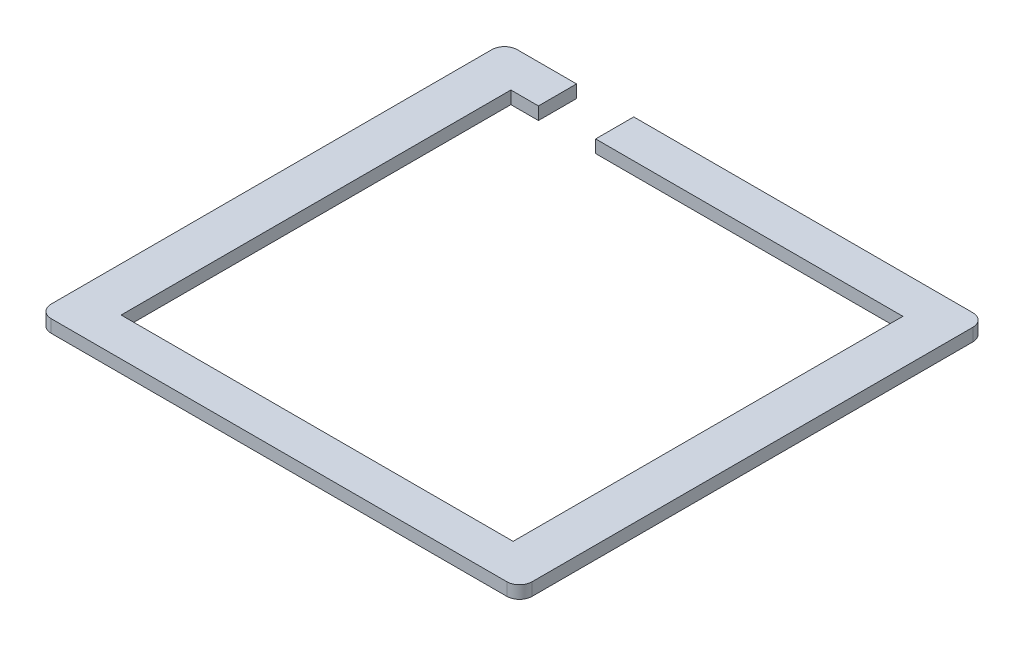
ISO-10303-21;
HEADER;
FILE_DESCRIPTION(('STEP AP214'),'2;1');
FILE_NAME('part.step','',(''),(''),'','','');
FILE_SCHEMA(('AUTOMOTIVE_DESIGN { 1 0 10303 214 1 1 1 1 }'));
ENDSEC;
DATA;
#1=APPLICATION_CONTEXT('core data for automotive mechanical design processes');
#2=APPLICATION_PROTOCOL_DEFINITION('international standard','automotive_design',2000,#1);
#3=PRODUCT_CONTEXT('',#1,'mechanical');
#4=PRODUCT('Part','Part','',(#3));
#5=PRODUCT_RELATED_PRODUCT_CATEGORY('part','',(#4));
#6=PRODUCT_DEFINITION_FORMATION('','',#4);
#7=PRODUCT_DEFINITION_CONTEXT('part definition',#1,'design');
#8=PRODUCT_DEFINITION('design','',#6,#7);
#9=PRODUCT_DEFINITION_SHAPE('','',#8);
#10=(LENGTH_UNIT() NAMED_UNIT(*) SI_UNIT(.MILLI.,.METRE.));
#11=(NAMED_UNIT(*) PLANE_ANGLE_UNIT() SI_UNIT($,.RADIAN.));
#12=(NAMED_UNIT(*) SI_UNIT($,.STERADIAN.) SOLID_ANGLE_UNIT());
#13=UNCERTAINTY_MEASURE_WITH_UNIT(LENGTH_MEASURE(1.E-05),#10,'distance_accuracy_value','');
#14=(GEOMETRIC_REPRESENTATION_CONTEXT(3) GLOBAL_UNCERTAINTY_ASSIGNED_CONTEXT((#13)) GLOBAL_UNIT_ASSIGNED_CONTEXT((#10,
#11,#12)) REPRESENTATION_CONTEXT('',''));
#15=CARTESIAN_POINT('',(0.,0.,0.));
#16=DIRECTION('',(0.,0.,1.));
#17=DIRECTION('',(1.,0.,0.));
#18=AXIS2_PLACEMENT_3D('',#15,#16,#17);
#19=CARTESIAN_POINT('',(-245.872231058257,-2419.78814298931,-89.0156255440787));
#20=DIRECTION('',(0.,0.,1.));
#21=DIRECTION('',(1.,0.,0.));
#22=AXIS2_PLACEMENT_3D('',#19,#20,#21);
#23=PLANE('',#22);
#24=DIRECTION('',(-1.,0.,0.));
#25=VECTOR('',#24,1.);
#26=CARTESIAN_POINT('',(-245.872231058257,-2419.78814298931,-89.0156255440787));
#27=LINE('',#26,#25);
#28=CARTESIAN_POINT('',(-236.533164197027,-2419.78814298931,-89.0156255440787));
#29=VERTEX_POINT('',#28);
#30=CARTESIAN_POINT('',(-245.872231058257,-2419.78814298931,-89.0156255440787));
#31=VERTEX_POINT('',#30);
#32=EDGE_CURVE('E190',#29,#31,#27,.T.);
#33=ORIENTED_EDGE('',*,*,#32,.F.);
#34=DIRECTION('',(0.,1.,0.));
#35=VECTOR('',#34,1.);
#36=CARTESIAN_POINT('',(-236.533164197027,-2421.78814298931,-89.0156255440787));
#37=LINE('',#36,#35);
#38=CARTESIAN_POINT('',(-236.533164197027,-2421.78814298931,-89.0156255440787));
#39=VERTEX_POINT('',#38);
#40=EDGE_CURVE('E263',#39,#29,#37,.T.);
#41=ORIENTED_EDGE('',*,*,#40,.F.);
#42=DIRECTION('',(-1.,0.,0.));
#43=VECTOR('',#42,1.);
#44=CARTESIAN_POINT('',(-245.872231058257,-2421.78814298931,-89.0156255440787));
#45=LINE('',#44,#43);
#46=CARTESIAN_POINT('',(-245.872231058257,-2421.78814298931,-89.0156255440787));
#47=VERTEX_POINT('',#46);
#48=EDGE_CURVE('E160',#39,#47,#45,.T.);
#49=ORIENTED_EDGE('',*,*,#48,.T.);
#50=DIRECTION('',(0.,-1.,0.));
#51=VECTOR('',#50,1.);
#52=CARTESIAN_POINT('',(-245.872231058257,-2419.78814298931,-89.0156255440787));
#53=LINE('',#52,#51);
#54=EDGE_CURVE('E41',#31,#47,#53,.T.);
#55=ORIENTED_EDGE('',*,*,#54,.F.);
#56=EDGE_LOOP('',(#33,#41,#49,#55));
#57=FACE_BOUND('',#56,.T.);
#58=ADVANCED_FACE('F33',(#57),#23,.F.);
#59=CARTESIAN_POINT('',(-240.872231058257,-2419.78814298931,-83.0156255440787));
#60=DIRECTION('',(0.,0.,1.));
#61=DIRECTION('',(1.,0.,0.));
#62=AXIS2_PLACEMENT_3D('',#59,#60,#61);
#63=PLANE('',#62);
#64=DIRECTION('',(0.,1.,0.));
#65=VECTOR('',#64,1.);
#66=CARTESIAN_POINT('',(-236.533164197027,-2421.78814298931,-83.0156255440787));
#67=LINE('',#66,#65);
#68=CARTESIAN_POINT('',(-236.533164197027,-2421.78814298931,-83.0156255440787));
#69=VERTEX_POINT('',#68);
#70=CARTESIAN_POINT('',(-236.533164197027,-2419.78814298931,-83.0156255440787));
#71=VERTEX_POINT('',#70);
#72=EDGE_CURVE('E143',#69,#71,#67,.T.);
#73=ORIENTED_EDGE('',*,*,#72,.T.);
#74=DIRECTION('',(-1.,0.,0.));
#75=VECTOR('',#74,1.);
#76=CARTESIAN_POINT('',(-240.872231058257,-2419.78814298931,-83.0156255440787));
#77=LINE('',#76,#75);
#78=CARTESIAN_POINT('',(-240.872231058257,-2419.78814298931,-83.0156255440787));
#79=VERTEX_POINT('',#78);
#80=EDGE_CURVE('E280',#71,#79,#77,.T.);
#81=ORIENTED_EDGE('',*,*,#80,.T.);
#82=DIRECTION('',(0.,-1.,0.));
#83=VECTOR('',#82,1.);
#84=CARTESIAN_POINT('',(-240.872231058257,-2419.78814298931,-83.0156255440787));
#85=LINE('',#84,#83);
#86=CARTESIAN_POINT('',(-240.872231058257,-2421.78814298931,-83.0156255440787));
#87=VERTEX_POINT('',#86);
#88=EDGE_CURVE('E166',#79,#87,#85,.T.);
#89=ORIENTED_EDGE('',*,*,#88,.T.);
#90=DIRECTION('',(-1.,0.,0.));
#91=VECTOR('',#90,1.);
#92=CARTESIAN_POINT('',(-240.872231058257,-2421.78814298931,-83.0156255440787));
#93=LINE('',#92,#91);
#94=EDGE_CURVE('E157',#69,#87,#93,.T.);
#95=ORIENTED_EDGE('',*,*,#94,.F.);
#96=EDGE_LOOP('',(#73,#81,#89,#95));
#97=FACE_BOUND('',#96,.T.);
#98=ADVANCED_FACE('F164',(#97),#63,.T.);
#99=CARTESIAN_POINT('',(-174.170088447034,-2419.78814298931,-87.0156255440787));
#100=DIRECTION('',(0.,-1.,0.));
#101=DIRECTION('',(0.,0.,-1.));
#102=AXIS2_PLACEMENT_3D('',#99,#100,#101);
#103=PLANE('',#102);
#104=ORIENTED_EDGE('',*,*,#80,.F.);
#105=DIRECTION('',(0.,0.,1.));
#106=VECTOR('',#105,1.);
#107=CARTESIAN_POINT('',(-236.533164197027,-2419.78814298931,-89.0156255440787));
#108=LINE('',#107,#106);
#109=EDGE_CURVE('E48',#29,#71,#108,.T.);
#110=ORIENTED_EDGE('',*,*,#109,.F.);
#111=ORIENTED_EDGE('',*,*,#32,.T.);
#112=CARTESIAN_POINT('',(-245.872231058257,-2419.78814298931,-87.0156255440787));
#113=DIRECTION('',(0.,1.,0.));
#114=DIRECTION('',(0.,0.,-1.));
#115=AXIS2_PLACEMENT_3D('',#112,#113,#114);
#116=CIRCLE('',#115,2.);
#117=CARTESIAN_POINT('',(-247.872231058257,-2419.78814298931,-87.0156255440787));
#118=VERTEX_POINT('',#117);
#119=EDGE_CURVE('E195',#31,#118,#116,.T.);
#120=ORIENTED_EDGE('',*,*,#119,.T.);
#121=DIRECTION('',(0.,0.,1.));
#122=VECTOR('',#121,1.);
#123=CARTESIAN_POINT('',(-247.872231058257,-2419.78814298931,-87.0156255440787));
#124=LINE('',#123,#122);
#125=CARTESIAN_POINT('',(-247.872231058257,-2419.78814298931,-17.6683856450978));
#126=VERTEX_POINT('',#125);
#127=EDGE_CURVE('E197',#118,#126,#124,.T.);
#128=ORIENTED_EDGE('',*,*,#127,.T.);
#129=CARTESIAN_POINT('',(-245.872231058257,-2419.78814298931,-17.6683856450978));
#130=DIRECTION('',(0.,1.,0.));
#131=DIRECTION('',(0.,0.,-1.));
#132=AXIS2_PLACEMENT_3D('',#129,#130,#131);
#133=CIRCLE('',#132,2.);
#134=CARTESIAN_POINT('',(-245.872231058257,-2419.78814298931,-15.6683856450978));
#135=VERTEX_POINT('',#134);
#136=EDGE_CURVE('E199',#126,#135,#133,.T.);
#137=ORIENTED_EDGE('',*,*,#136,.T.);
#138=DIRECTION('',(1.,0.,0.));
#139=VECTOR('',#138,1.);
#140=CARTESIAN_POINT('',(-245.872231058257,-2419.78814298931,-15.6683856450978));
#141=LINE('',#140,#139);
#142=CARTESIAN_POINT('',(-174.170088447034,-2419.78814298931,-15.6683856450978));
#143=VERTEX_POINT('',#142);
#144=EDGE_CURVE('E201',#135,#143,#141,.T.);
#145=ORIENTED_EDGE('',*,*,#144,.T.);
#146=CARTESIAN_POINT('',(-174.170088447034,-2419.78814298931,-17.6683856450978));
#147=DIRECTION('',(0.,1.,0.));
#148=DIRECTION('',(0.,0.,-1.));
#149=AXIS2_PLACEMENT_3D('',#146,#147,#148);
#150=CIRCLE('',#149,2.);
#151=CARTESIAN_POINT('',(-172.170088447034,-2419.78814298931,-17.6683856450978));
#152=VERTEX_POINT('',#151);
#153=EDGE_CURVE('E203',#143,#152,#150,.T.);
#154=ORIENTED_EDGE('',*,*,#153,.T.);
#155=DIRECTION('',(0.,0.,-1.));
#156=VECTOR('',#155,1.);
#157=CARTESIAN_POINT('',(-172.170088447034,-2419.78814298931,-87.0156255440787));
#158=LINE('',#157,#156);
#159=CARTESIAN_POINT('',(-172.170088447034,-2419.78814298931,-87.0156255440787));
#160=VERTEX_POINT('',#159);
#161=EDGE_CURVE('E205',#152,#160,#158,.T.);
#162=ORIENTED_EDGE('',*,*,#161,.T.);
#163=CARTESIAN_POINT('',(-174.170088447034,-2419.78814298931,-87.0156255440787));
#164=DIRECTION('',(0.,1.,0.));
#165=DIRECTION('',(0.,0.,-1.));
#166=AXIS2_PLACEMENT_3D('',#163,#164,#165);
#167=CIRCLE('',#166,2.);
#168=CARTESIAN_POINT('',(-174.170088447034,-2419.78814298931,-89.0156255440787));
#169=VERTEX_POINT('',#168);
#170=EDGE_CURVE('E187',#160,#169,#167,.T.);
#171=ORIENTED_EDGE('',*,*,#170,.T.);
#172=CARTESIAN_POINT('',(-227.533164197027,-2419.78814298931,-89.0156255440787));
#173=VERTEX_POINT('',#172);
#174=EDGE_CURVE('E192',#169,#173,#27,.T.);
#175=ORIENTED_EDGE('',*,*,#174,.T.);
#176=DIRECTION('',(0.,0.,-1.));
#177=VECTOR('',#176,1.);
#178=CARTESIAN_POINT('',(-227.533164197027,-2419.78814298931,-89.0156255440787));
#179=LINE('',#178,#177);
#180=CARTESIAN_POINT('',(-227.533164197027,-2419.78814298931,-83.0156255440787));
#181=VERTEX_POINT('',#180);
#182=EDGE_CURVE('E161',#181,#173,#179,.T.);
#183=ORIENTED_EDGE('',*,*,#182,.F.);
#184=CARTESIAN_POINT('',(-179.170088447034,-2419.78814298931,-83.0156255440787));
#185=VERTEX_POINT('',#184);
#186=EDGE_CURVE('E179',#185,#181,#77,.T.);
#187=ORIENTED_EDGE('',*,*,#186,.F.);
#188=DIRECTION('',(0.,0.,-1.));
#189=VECTOR('',#188,1.);
#190=CARTESIAN_POINT('',(-179.170088447034,-2419.78814298931,-83.0156255440787));
#191=LINE('',#190,#189);
#192=CARTESIAN_POINT('',(-179.170088447034,-2419.78814298931,-21.6683856450978));
#193=VERTEX_POINT('',#192);
#194=EDGE_CURVE('E277',#193,#185,#191,.T.);
#195=ORIENTED_EDGE('',*,*,#194,.F.);
#196=DIRECTION('',(1.,0.,0.));
#197=VECTOR('',#196,1.);
#198=CARTESIAN_POINT('',(-240.872231058257,-2419.78814298931,-21.6683856450978));
#199=LINE('',#198,#197);
#200=CARTESIAN_POINT('',(-240.872231058257,-2419.78814298931,-21.6683856450978));
#201=VERTEX_POINT('',#200);
#202=EDGE_CURVE('E275',#201,#193,#199,.T.);
#203=ORIENTED_EDGE('',*,*,#202,.F.);
#204=DIRECTION('',(0.,0.,1.));
#205=VECTOR('',#204,1.);
#206=CARTESIAN_POINT('',(-240.872231058257,-2419.78814298931,-83.0156255440787));
#207=LINE('',#206,#205);
#208=EDGE_CURVE('E171',#79,#201,#207,.T.);
#209=ORIENTED_EDGE('',*,*,#208,.F.);
#210=EDGE_LOOP('',(#104,#110,#111,#120,#128,#137,#145,#154,#162,#171,#175,#183,#187,#195,#203,#209));
#211=FACE_BOUND('',#210,.T.);
#212=ADVANCED_FACE('F261',(#211),#103,.F.);
#213=CARTESIAN_POINT('',(-174.170088447034,-2421.78814298931,-87.0156255440787));
#214=DIRECTION('',(0.,-1.,0.));
#215=DIRECTION('',(0.,0.,-1.));
#216=AXIS2_PLACEMENT_3D('',#213,#214,#215);
#217=PLANE('',#216);
#218=DIRECTION('',(0.,0.,1.));
#219=VECTOR('',#218,1.);
#220=CARTESIAN_POINT('',(-236.533164197027,-2421.78814298931,-89.0156255440787));
#221=LINE('',#220,#219);
#222=EDGE_CURVE('E146',#39,#69,#221,.T.);
#223=ORIENTED_EDGE('',*,*,#222,.T.);
#224=ORIENTED_EDGE('',*,*,#94,.T.);
#225=DIRECTION('',(0.,0.,1.));
#226=VECTOR('',#225,1.);
#227=CARTESIAN_POINT('',(-240.872231058257,-2421.78814298931,-83.0156255440787));
#228=LINE('',#227,#226);
#229=CARTESIAN_POINT('',(-240.872231058257,-2421.78814298931,-21.6683856450978));
#230=VERTEX_POINT('',#229);
#231=EDGE_CURVE('E264',#87,#230,#228,.T.);
#232=ORIENTED_EDGE('',*,*,#231,.T.);
#233=DIRECTION('',(1.,0.,0.));
#234=VECTOR('',#233,1.);
#235=CARTESIAN_POINT('',(-240.872231058257,-2421.78814298931,-21.6683856450978));
#236=LINE('',#235,#234);
#237=CARTESIAN_POINT('',(-179.170088447034,-2421.78814298931,-21.6683856450978));
#238=VERTEX_POINT('',#237);
#239=EDGE_CURVE('E173',#230,#238,#236,.T.);
#240=ORIENTED_EDGE('',*,*,#239,.T.);
#241=DIRECTION('',(0.,0.,-1.));
#242=VECTOR('',#241,1.);
#243=CARTESIAN_POINT('',(-179.170088447034,-2421.78814298931,-83.0156255440787));
#244=LINE('',#243,#242);
#245=CARTESIAN_POINT('',(-179.170088447034,-2421.78814298931,-83.0156255440787));
#246=VERTEX_POINT('',#245);
#247=EDGE_CURVE('E168',#238,#246,#244,.T.);
#248=ORIENTED_EDGE('',*,*,#247,.T.);
#249=CARTESIAN_POINT('',(-227.533164197027,-2421.78814298931,-83.0156255440787));
#250=VERTEX_POINT('',#249);
#251=EDGE_CURVE('E167',#246,#250,#93,.T.);
#252=ORIENTED_EDGE('',*,*,#251,.T.);
#253=DIRECTION('',(0.,0.,-1.));
#254=VECTOR('',#253,1.);
#255=CARTESIAN_POINT('',(-227.533164197027,-2421.78814298931,-89.0156255440787));
#256=LINE('',#255,#254);
#257=CARTESIAN_POINT('',(-227.533164197027,-2421.78814298931,-89.0156255440787));
#258=VERTEX_POINT('',#257);
#259=EDGE_CURVE('E56',#250,#258,#256,.T.);
#260=ORIENTED_EDGE('',*,*,#259,.T.);
#261=CARTESIAN_POINT('',(-174.170088447034,-2421.78814298931,-89.0156255440787));
#262=VERTEX_POINT('',#261);
#263=EDGE_CURVE('E210',#262,#258,#45,.T.);
#264=ORIENTED_EDGE('',*,*,#263,.F.);
#265=CARTESIAN_POINT('',(-174.170088447034,-2421.78814298931,-87.0156255440787));
#266=DIRECTION('',(0.,1.,0.));
#267=DIRECTION('',(0.,0.,-1.));
#268=AXIS2_PLACEMENT_3D('',#265,#266,#267);
#269=CIRCLE('',#268,2.);
#270=CARTESIAN_POINT('',(-172.170088447034,-2421.78814298931,-87.0156255440787));
#271=VERTEX_POINT('',#270);
#272=EDGE_CURVE('E186',#271,#262,#269,.T.);
#273=ORIENTED_EDGE('',*,*,#272,.F.);
#274=DIRECTION('',(0.,0.,-1.));
#275=VECTOR('',#274,1.);
#276=CARTESIAN_POINT('',(-172.170088447034,-2421.78814298931,-87.0156255440787));
#277=LINE('',#276,#275);
#278=CARTESIAN_POINT('',(-172.170088447034,-2421.78814298931,-17.6683856450978));
#279=VERTEX_POINT('',#278);
#280=EDGE_CURVE('E191',#279,#271,#277,.T.);
#281=ORIENTED_EDGE('',*,*,#280,.F.);
#282=CARTESIAN_POINT('',(-174.170088447034,-2421.78814298931,-17.6683856450978));
#283=DIRECTION('',(0.,1.,0.));
#284=DIRECTION('',(0.,0.,-1.));
#285=AXIS2_PLACEMENT_3D('',#282,#283,#284);
#286=CIRCLE('',#285,2.);
#287=CARTESIAN_POINT('',(-174.170088447034,-2421.78814298931,-15.6683856450978));
#288=VERTEX_POINT('',#287);
#289=EDGE_CURVE('E221',#288,#279,#286,.T.);
#290=ORIENTED_EDGE('',*,*,#289,.F.);
#291=DIRECTION('',(1.,0.,0.));
#292=VECTOR('',#291,1.);
#293=CARTESIAN_POINT('',(-245.872231058257,-2421.78814298931,-15.6683856450978));
#294=LINE('',#293,#292);
#295=CARTESIAN_POINT('',(-245.872231058257,-2421.78814298931,-15.6683856450978));
#296=VERTEX_POINT('',#295);
#297=EDGE_CURVE('E219',#296,#288,#294,.T.);
#298=ORIENTED_EDGE('',*,*,#297,.F.);
#299=CARTESIAN_POINT('',(-245.872231058257,-2421.78814298931,-17.6683856450978));
#300=DIRECTION('',(0.,1.,0.));
#301=DIRECTION('',(0.,0.,-1.));
#302=AXIS2_PLACEMENT_3D('',#299,#300,#301);
#303=CIRCLE('',#302,2.);
#304=CARTESIAN_POINT('',(-247.872231058257,-2421.78814298931,-17.6683856450978));
#305=VERTEX_POINT('',#304);
#306=EDGE_CURVE('E217',#305,#296,#303,.T.);
#307=ORIENTED_EDGE('',*,*,#306,.F.);
#308=DIRECTION('',(0.,0.,1.));
#309=VECTOR('',#308,1.);
#310=CARTESIAN_POINT('',(-247.872231058257,-2421.78814298931,-87.0156255440787));
#311=LINE('',#310,#309);
#312=CARTESIAN_POINT('',(-247.872231058257,-2421.78814298931,-87.0156255440787));
#313=VERTEX_POINT('',#312);
#314=EDGE_CURVE('E215',#313,#305,#311,.T.);
#315=ORIENTED_EDGE('',*,*,#314,.F.);
#316=CARTESIAN_POINT('',(-245.872231058257,-2421.78814298931,-87.0156255440787));
#317=DIRECTION('',(0.,1.,0.));
#318=DIRECTION('',(0.,0.,-1.));
#319=AXIS2_PLACEMENT_3D('',#316,#317,#318);
#320=CIRCLE('',#319,2.);
#321=EDGE_CURVE('E213',#47,#313,#320,.T.);
#322=ORIENTED_EDGE('',*,*,#321,.F.);
#323=ORIENTED_EDGE('',*,*,#48,.F.);
#324=EDGE_LOOP('',(#223,#224,#232,#240,#248,#252,#260,#264,#273,#281,#290,#298,#307,#315,#322,#323));
#325=FACE_BOUND('',#324,.T.);
#326=ADVANCED_FACE('F155',(#325),#217,.T.);
#327=CARTESIAN_POINT('',(-174.170088447034,-2419.78814298931,-87.0156255440787));
#328=DIRECTION('',(0.,-1.,0.));
#329=DIRECTION('',(0.,0.,-1.));
#330=AXIS2_PLACEMENT_3D('',#327,#328,#329);
#331=CYLINDRICAL_SURFACE('',#330,2.);
#332=ORIENTED_EDGE('',*,*,#272,.T.);
#333=DIRECTION('',(0.,-1.,0.));
#334=VECTOR('',#333,1.);
#335=CARTESIAN_POINT('',(-174.170088447034,-2419.78814298931,-89.0156255440787));
#336=LINE('',#335,#334);
#337=EDGE_CURVE('E11',#169,#262,#336,.T.);
#338=ORIENTED_EDGE('',*,*,#337,.F.);
#339=ORIENTED_EDGE('',*,*,#170,.F.);
#340=DIRECTION('',(0.,-1.,0.));
#341=VECTOR('',#340,1.);
#342=CARTESIAN_POINT('',(-172.170088447034,-2419.78814298931,-87.0156255440787));
#343=LINE('',#342,#341);
#344=EDGE_CURVE('E207',#160,#271,#343,.T.);
#345=ORIENTED_EDGE('',*,*,#344,.T.);
#346=EDGE_LOOP('',(#332,#338,#339,#345));
#347=FACE_BOUND('',#346,.T.);
#348=ADVANCED_FACE('F35',(#347),#331,.T.);
#349=ORIENTED_EDGE('',*,*,#263,.T.);
#350=DIRECTION('',(0.,1.,0.));
#351=VECTOR('',#350,1.);
#352=CARTESIAN_POINT('',(-227.533164197027,-2421.78814298931,-89.0156255440787));
#353=LINE('',#352,#351);
#354=EDGE_CURVE('E265',#258,#173,#353,.T.);
#355=ORIENTED_EDGE('',*,*,#354,.T.);
#356=ORIENTED_EDGE('',*,*,#174,.F.);
#357=ORIENTED_EDGE('',*,*,#337,.T.);
#358=EDGE_LOOP('',(#349,#355,#356,#357));
#359=FACE_BOUND('',#358,.T.);
#360=ADVANCED_FACE('F302',(#359),#23,.F.);
#361=CARTESIAN_POINT('',(-245.872231058257,-2419.78814298931,-87.0156255440787));
#362=DIRECTION('',(0.,-1.,0.));
#363=DIRECTION('',(0.,0.,-1.));
#364=AXIS2_PLACEMENT_3D('',#361,#362,#363);
#365=CYLINDRICAL_SURFACE('',#364,2.);
#366=ORIENTED_EDGE('',*,*,#321,.T.);
#367=DIRECTION('',(0.,-1.,0.));
#368=VECTOR('',#367,1.);
#369=CARTESIAN_POINT('',(-247.872231058257,-2419.78814298931,-87.0156255440787));
#370=LINE('',#369,#368);
#371=EDGE_CURVE('E238',#118,#313,#370,.T.);
#372=ORIENTED_EDGE('',*,*,#371,.F.);
#373=ORIENTED_EDGE('',*,*,#119,.F.);
#374=ORIENTED_EDGE('',*,*,#54,.T.);
#375=EDGE_LOOP('',(#366,#372,#373,#374));
#376=FACE_BOUND('',#375,.T.);
#377=ADVANCED_FACE('F244',(#376),#365,.T.);
#378=CARTESIAN_POINT('',(-247.872231058257,-2419.78814298931,-87.0156255440787));
#379=DIRECTION('',(1.,0.,0.));
#380=DIRECTION('',(0.,0.,-1.));
#381=AXIS2_PLACEMENT_3D('',#378,#379,#380);
#382=PLANE('',#381);
#383=ORIENTED_EDGE('',*,*,#314,.T.);
#384=DIRECTION('',(0.,-1.,0.));
#385=VECTOR('',#384,1.);
#386=CARTESIAN_POINT('',(-247.872231058257,-2419.78814298931,-17.6683856450978));
#387=LINE('',#386,#385);
#388=EDGE_CURVE('E235',#126,#305,#387,.T.);
#389=ORIENTED_EDGE('',*,*,#388,.F.);
#390=ORIENTED_EDGE('',*,*,#127,.F.);
#391=ORIENTED_EDGE('',*,*,#371,.T.);
#392=EDGE_LOOP('',(#383,#389,#390,#391));
#393=FACE_BOUND('',#392,.T.);
#394=ADVANCED_FACE('F253',(#393),#382,.F.);
#395=CARTESIAN_POINT('',(-245.872231058257,-2419.78814298931,-17.6683856450978));
#396=DIRECTION('',(0.,-1.,0.));
#397=DIRECTION('',(0.,0.,-1.));
#398=AXIS2_PLACEMENT_3D('',#395,#396,#397);
#399=CYLINDRICAL_SURFACE('',#398,2.);
#400=ORIENTED_EDGE('',*,*,#306,.T.);
#401=DIRECTION('',(0.,-1.,0.));
#402=VECTOR('',#401,1.);
#403=CARTESIAN_POINT('',(-245.872231058257,-2419.78814298931,-15.6683856450978));
#404=LINE('',#403,#402);
#405=EDGE_CURVE('E232',#135,#296,#404,.T.);
#406=ORIENTED_EDGE('',*,*,#405,.F.);
#407=ORIENTED_EDGE('',*,*,#136,.F.);
#408=ORIENTED_EDGE('',*,*,#388,.T.);
#409=EDGE_LOOP('',(#400,#406,#407,#408));
#410=FACE_BOUND('',#409,.T.);
#411=ADVANCED_FACE('F257',(#410),#399,.T.);
#412=CARTESIAN_POINT('',(-245.872231058257,-2419.78814298931,-15.6683856450978));
#413=DIRECTION('',(0.,0.,-1.));
#414=DIRECTION('',(-1.,0.,0.));
#415=AXIS2_PLACEMENT_3D('',#412,#413,#414);
#416=PLANE('',#415);
#417=ORIENTED_EDGE('',*,*,#297,.T.);
#418=DIRECTION('',(0.,-1.,0.));
#419=VECTOR('',#418,1.);
#420=CARTESIAN_POINT('',(-174.170088447034,-2419.78814298931,-15.6683856450978));
#421=LINE('',#420,#419);
#422=EDGE_CURVE('E229',#143,#288,#421,.T.);
#423=ORIENTED_EDGE('',*,*,#422,.F.);
#424=ORIENTED_EDGE('',*,*,#144,.F.);
#425=ORIENTED_EDGE('',*,*,#405,.T.);
#426=EDGE_LOOP('',(#417,#423,#424,#425));
#427=FACE_BOUND('',#426,.T.);
#428=ADVANCED_FACE('F317',(#427),#416,.F.);
#429=CARTESIAN_POINT('',(-174.170088447034,-2419.78814298931,-17.6683856450978));
#430=DIRECTION('',(0.,-1.,0.));
#431=DIRECTION('',(0.,0.,-1.));
#432=AXIS2_PLACEMENT_3D('',#429,#430,#431);
#433=CYLINDRICAL_SURFACE('',#432,2.);
#434=ORIENTED_EDGE('',*,*,#289,.T.);
#435=DIRECTION('',(0.,-1.,0.));
#436=VECTOR('',#435,1.);
#437=CARTESIAN_POINT('',(-172.170088447034,-2419.78814298931,-17.6683856450978));
#438=LINE('',#437,#436);
#439=EDGE_CURVE('E226',#152,#279,#438,.T.);
#440=ORIENTED_EDGE('',*,*,#439,.F.);
#441=ORIENTED_EDGE('',*,*,#153,.F.);
#442=ORIENTED_EDGE('',*,*,#422,.T.);
#443=EDGE_LOOP('',(#434,#440,#441,#442));
#444=FACE_BOUND('',#443,.T.);
#445=ADVANCED_FACE('F315',(#444),#433,.T.);
#446=CARTESIAN_POINT('',(-172.170088447034,-2419.78814298931,-87.0156255440787));
#447=DIRECTION('',(-1.,0.,0.));
#448=DIRECTION('',(0.,0.,1.));
#449=AXIS2_PLACEMENT_3D('',#446,#447,#448);
#450=PLANE('',#449);
#451=ORIENTED_EDGE('',*,*,#280,.T.);
#452=ORIENTED_EDGE('',*,*,#344,.F.);
#453=ORIENTED_EDGE('',*,*,#161,.F.);
#454=ORIENTED_EDGE('',*,*,#439,.T.);
#455=EDGE_LOOP('',(#451,#452,#453,#454));
#456=FACE_BOUND('',#455,.T.);
#457=ADVANCED_FACE('F310',(#456),#450,.F.);
#458=CARTESIAN_POINT('',(-240.872231058257,-2419.78814298931,-83.0156255440787));
#459=DIRECTION('',(1.,0.,0.));
#460=DIRECTION('',(0.,0.,-1.));
#461=AXIS2_PLACEMENT_3D('',#458,#459,#460);
#462=PLANE('',#461);
#463=ORIENTED_EDGE('',*,*,#231,.F.);
#464=ORIENTED_EDGE('',*,*,#88,.F.);
#465=ORIENTED_EDGE('',*,*,#208,.T.);
#466=DIRECTION('',(0.,-1.,0.));
#467=VECTOR('',#466,1.);
#468=CARTESIAN_POINT('',(-240.872231058257,-2419.78814298931,-21.6683856450978));
#469=LINE('',#468,#467);
#470=EDGE_CURVE('E183',#201,#230,#469,.T.);
#471=ORIENTED_EDGE('',*,*,#470,.T.);
#472=EDGE_LOOP('',(#463,#464,#465,#471));
#473=FACE_BOUND('',#472,.T.);
#474=ADVANCED_FACE('F290',(#473),#462,.T.);
#475=CARTESIAN_POINT('',(-240.872231058257,-2419.78814298931,-21.6683856450978));
#476=DIRECTION('',(0.,0.,-1.));
#477=DIRECTION('',(-1.,0.,0.));
#478=AXIS2_PLACEMENT_3D('',#475,#476,#477);
#479=PLANE('',#478);
#480=ORIENTED_EDGE('',*,*,#239,.F.);
#481=ORIENTED_EDGE('',*,*,#470,.F.);
#482=ORIENTED_EDGE('',*,*,#202,.T.);
#483=DIRECTION('',(0.,-1.,0.));
#484=VECTOR('',#483,1.);
#485=CARTESIAN_POINT('',(-179.170088447034,-2419.78814298931,-21.6683856450978));
#486=LINE('',#485,#484);
#487=EDGE_CURVE('E181',#193,#238,#486,.T.);
#488=ORIENTED_EDGE('',*,*,#487,.T.);
#489=EDGE_LOOP('',(#480,#481,#482,#488));
#490=FACE_BOUND('',#489,.T.);
#491=ADVANCED_FACE('F286',(#490),#479,.T.);
#492=CARTESIAN_POINT('',(-179.170088447034,-2419.78814298931,-83.0156255440787));
#493=DIRECTION('',(-1.,0.,0.));
#494=DIRECTION('',(0.,0.,1.));
#495=AXIS2_PLACEMENT_3D('',#492,#493,#494);
#496=PLANE('',#495);
#497=ORIENTED_EDGE('',*,*,#247,.F.);
#498=ORIENTED_EDGE('',*,*,#487,.F.);
#499=ORIENTED_EDGE('',*,*,#194,.T.);
#500=DIRECTION('',(0.,-1.,0.));
#501=VECTOR('',#500,1.);
#502=CARTESIAN_POINT('',(-179.170088447034,-2419.78814298931,-83.0156255440787));
#503=LINE('',#502,#501);
#504=EDGE_CURVE('E178',#185,#246,#503,.T.);
#505=ORIENTED_EDGE('',*,*,#504,.T.);
#506=EDGE_LOOP('',(#497,#498,#499,#505));
#507=FACE_BOUND('',#506,.T.);
#508=ADVANCED_FACE('F295',(#507),#496,.T.);
#509=DIRECTION('',(0.,1.,0.));
#510=VECTOR('',#509,1.);
#511=CARTESIAN_POINT('',(-227.533164197027,-2421.78814298931,-83.0156255440787));
#512=LINE('',#511,#510);
#513=EDGE_CURVE('E151',#250,#181,#512,.T.);
#514=ORIENTED_EDGE('',*,*,#513,.F.);
#515=ORIENTED_EDGE('',*,*,#251,.F.);
#516=ORIENTED_EDGE('',*,*,#504,.F.);
#517=ORIENTED_EDGE('',*,*,#186,.T.);
#518=EDGE_LOOP('',(#514,#515,#516,#517));
#519=FACE_BOUND('',#518,.T.);
#520=ADVANCED_FACE('F298',(#519),#63,.T.);
#521=CARTESIAN_POINT('',(-227.533164197027,-2421.78814298931,-89.0156255440787));
#522=DIRECTION('',(1.,0.,0.));
#523=DIRECTION('',(0.,0.,-1.));
#524=AXIS2_PLACEMENT_3D('',#521,#522,#523);
#525=PLANE('',#524);
#526=ORIENTED_EDGE('',*,*,#182,.T.);
#527=ORIENTED_EDGE('',*,*,#354,.F.);
#528=ORIENTED_EDGE('',*,*,#259,.F.);
#529=ORIENTED_EDGE('',*,*,#513,.T.);
#530=EDGE_LOOP('',(#526,#527,#528,#529));
#531=FACE_BOUND('',#530,.T.);
#532=ADVANCED_FACE('F359',(#531),#525,.F.);
#533=CARTESIAN_POINT('',(-236.533164197027,-2421.78814298931,-89.0156255440787));
#534=DIRECTION('',(-1.,0.,0.));
#535=DIRECTION('',(0.,0.,1.));
#536=AXIS2_PLACEMENT_3D('',#533,#534,#535);
#537=PLANE('',#536);
#538=ORIENTED_EDGE('',*,*,#109,.T.);
#539=ORIENTED_EDGE('',*,*,#72,.F.);
#540=ORIENTED_EDGE('',*,*,#222,.F.);
#541=ORIENTED_EDGE('',*,*,#40,.T.);
#542=EDGE_LOOP('',(#538,#539,#540,#541));
#543=FACE_BOUND('',#542,.T.);
#544=ADVANCED_FACE('F145',(#543),#537,.F.);
#545=CLOSED_SHELL('',(#58,#98,#212,#326,#348,#360,#377,#394,#411,#428,#445,#457,#474,#491,#508,
#520,#532,#544));
#546=MANIFOLD_SOLID_BREP('B2',#545);
#547=ADVANCED_BREP_SHAPE_REPRESENTATION('',(#18,#546),#14);
#548=SHAPE_DEFINITION_REPRESENTATION(#9,#547);
ENDSEC;
END-ISO-10303-21;
